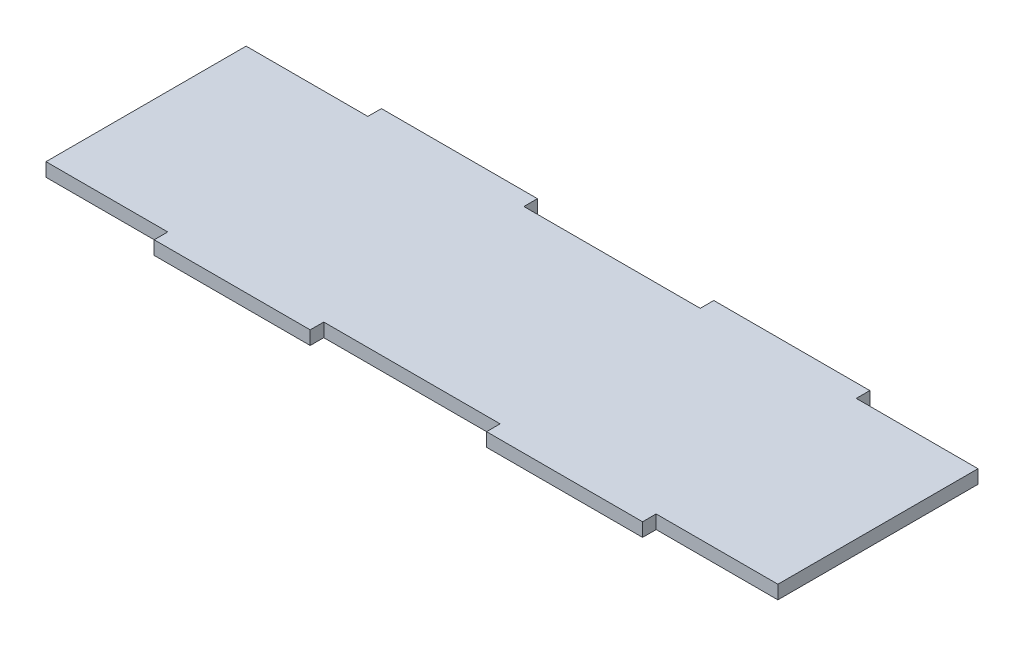
ISO-10303-21;
HEADER;
FILE_DESCRIPTION(('STEP AP214'),'2;1');
FILE_NAME('part.step','',(''),(''),'','','');
FILE_SCHEMA(('AUTOMOTIVE_DESIGN { 1 0 10303 214 1 1 1 1 }'));
ENDSEC;
DATA;
#1=APPLICATION_CONTEXT('core data for automotive mechanical design processes');
#2=APPLICATION_PROTOCOL_DEFINITION('international standard','automotive_design',2000,#1);
#3=PRODUCT_CONTEXT('',#1,'mechanical');
#4=PRODUCT('Part','Part','',(#3));
#5=PRODUCT_RELATED_PRODUCT_CATEGORY('part','',(#4));
#6=PRODUCT_DEFINITION_FORMATION('','',#4);
#7=PRODUCT_DEFINITION_CONTEXT('part definition',#1,'design');
#8=PRODUCT_DEFINITION('design','',#6,#7);
#9=PRODUCT_DEFINITION_SHAPE('','',#8);
#10=(LENGTH_UNIT() NAMED_UNIT(*) SI_UNIT(.MILLI.,.METRE.));
#11=(NAMED_UNIT(*) PLANE_ANGLE_UNIT() SI_UNIT($,.RADIAN.));
#12=(NAMED_UNIT(*) SI_UNIT($,.STERADIAN.) SOLID_ANGLE_UNIT());
#13=UNCERTAINTY_MEASURE_WITH_UNIT(LENGTH_MEASURE(1.E-05),#10,'distance_accuracy_value','');
#14=(GEOMETRIC_REPRESENTATION_CONTEXT(3) GLOBAL_UNCERTAINTY_ASSIGNED_CONTEXT((#13)) GLOBAL_UNIT_ASSIGNED_CONTEXT((#10,
#11,#12)) REPRESENTATION_CONTEXT('',''));
#15=CARTESIAN_POINT('',(0.,0.,0.));
#16=DIRECTION('',(0.,0.,1.));
#17=DIRECTION('',(1.,0.,0.));
#18=AXIS2_PLACEMENT_3D('',#15,#16,#17);
#19=CARTESIAN_POINT('',(-53.95,2.,14.75));
#20=DIRECTION('',(0.,0.,-1.));
#21=DIRECTION('',(-1.,0.,0.));
#22=AXIS2_PLACEMENT_3D('',#19,#20,#21);
#23=PLANE('',#22);
#24=DIRECTION('',(1.,0.,0.));
#25=VECTOR('',#24,1.);
#26=CARTESIAN_POINT('',(-53.95,2.,14.75));
#27=LINE('',#26,#25);
#28=CARTESIAN_POINT('',(-13.,2.,14.75));
#29=VERTEX_POINT('',#28);
#30=CARTESIAN_POINT('',(13.,2.,14.75));
#31=VERTEX_POINT('',#30);
#32=EDGE_CURVE('E55',#29,#31,#27,.T.);
#33=ORIENTED_EDGE('',*,*,#32,.F.);
#34=DIRECTION('',(0.,1.,0.));
#35=VECTOR('',#34,1.);
#36=CARTESIAN_POINT('',(-13.,0.,14.75));
#37=LINE('',#36,#35);
#38=CARTESIAN_POINT('',(-13.,0.,14.75));
#39=VERTEX_POINT('',#38);
#40=EDGE_CURVE('E218',#39,#29,#37,.T.);
#41=ORIENTED_EDGE('',*,*,#40,.F.);
#42=DIRECTION('',(1.,0.,0.));
#43=VECTOR('',#42,1.);
#44=CARTESIAN_POINT('',(-53.95,0.,14.75));
#45=LINE('',#44,#43);
#46=CARTESIAN_POINT('',(13.,0.,14.75));
#47=VERTEX_POINT('',#46);
#48=EDGE_CURVE('E367',#39,#47,#45,.T.);
#49=ORIENTED_EDGE('',*,*,#48,.T.);
#50=DIRECTION('',(0.,1.,0.));
#51=VECTOR('',#50,1.);
#52=CARTESIAN_POINT('',(13.,0.,14.75));
#53=LINE('',#52,#51);
#54=EDGE_CURVE('E238',#47,#31,#53,.T.);
#55=ORIENTED_EDGE('',*,*,#54,.T.);
#56=EDGE_LOOP('',(#33,#41,#49,#55));
#57=FACE_BOUND('',#56,.T.);
#58=ADVANCED_FACE('F39',(#57),#23,.F.);
#59=DIRECTION('',(0.,1.,0.));
#60=VECTOR('',#59,1.);
#61=CARTESIAN_POINT('',(36.,0.,14.75));
#62=LINE('',#61,#60);
#63=CARTESIAN_POINT('',(36.,0.,14.75));
#64=VERTEX_POINT('',#63);
#65=CARTESIAN_POINT('',(36.,2.,14.75));
#66=VERTEX_POINT('',#65);
#67=EDGE_CURVE('E249',#64,#66,#62,.T.);
#68=ORIENTED_EDGE('',*,*,#67,.F.);
#69=CARTESIAN_POINT('',(53.95,0.,14.75));
#70=VERTEX_POINT('',#69);
#71=EDGE_CURVE('E364',#64,#70,#45,.T.);
#72=ORIENTED_EDGE('',*,*,#71,.T.);
#73=DIRECTION('',(0.,-1.,0.));
#74=VECTOR('',#73,1.);
#75=CARTESIAN_POINT('',(53.95,2.,14.75));
#76=LINE('',#75,#74);
#77=CARTESIAN_POINT('',(53.95,2.,14.75));
#78=VERTEX_POINT('',#77);
#79=EDGE_CURVE('E352',#78,#70,#76,.T.);
#80=ORIENTED_EDGE('',*,*,#79,.F.);
#81=EDGE_CURVE('E348',#66,#78,#27,.T.);
#82=ORIENTED_EDGE('',*,*,#81,.F.);
#83=EDGE_LOOP('',(#68,#72,#80,#82));
#84=FACE_BOUND('',#83,.T.);
#85=ADVANCED_FACE('F423',(#84),#23,.F.);
#86=CARTESIAN_POINT('',(-53.95,2.,-14.75));
#87=DIRECTION('',(0.,0.,1.));
#88=DIRECTION('',(1.,0.,0.));
#89=AXIS2_PLACEMENT_3D('',#86,#87,#88);
#90=PLANE('',#89);
#91=DIRECTION('',(-1.,0.,0.));
#92=VECTOR('',#91,1.);
#93=CARTESIAN_POINT('',(-53.95,2.,-14.75));
#94=LINE('',#93,#92);
#95=CARTESIAN_POINT('',(13.,2.,-14.75));
#96=VERTEX_POINT('',#95);
#97=CARTESIAN_POINT('',(-13.,2.,-14.75));
#98=VERTEX_POINT('',#97);
#99=EDGE_CURVE('E345',#96,#98,#94,.T.);
#100=ORIENTED_EDGE('',*,*,#99,.F.);
#101=DIRECTION('',(0.,1.,0.));
#102=VECTOR('',#101,1.);
#103=CARTESIAN_POINT('',(13.,0.,-14.75));
#104=LINE('',#103,#102);
#105=CARTESIAN_POINT('',(13.,0.,-14.75));
#106=VERTEX_POINT('',#105);
#107=EDGE_CURVE('E274',#106,#96,#104,.T.);
#108=ORIENTED_EDGE('',*,*,#107,.F.);
#109=DIRECTION('',(-1.,0.,0.));
#110=VECTOR('',#109,1.);
#111=CARTESIAN_POINT('',(-53.95,0.,-14.75));
#112=LINE('',#111,#110);
#113=CARTESIAN_POINT('',(-13.,0.,-14.75));
#114=VERTEX_POINT('',#113);
#115=EDGE_CURVE('E361',#106,#114,#112,.T.);
#116=ORIENTED_EDGE('',*,*,#115,.T.);
#117=DIRECTION('',(0.,1.,0.));
#118=VECTOR('',#117,1.);
#119=CARTESIAN_POINT('',(-13.,0.,-14.75));
#120=LINE('',#119,#118);
#121=EDGE_CURVE('E328',#114,#98,#120,.T.);
#122=ORIENTED_EDGE('',*,*,#121,.T.);
#123=EDGE_LOOP('',(#100,#108,#116,#122));
#124=FACE_BOUND('',#123,.T.);
#125=ADVANCED_FACE('F402',(#124),#90,.F.);
#126=DIRECTION('',(0.,1.,0.));
#127=VECTOR('',#126,1.);
#128=CARTESIAN_POINT('',(-36.,0.,-14.75));
#129=LINE('',#128,#127);
#130=CARTESIAN_POINT('',(-36.,0.,-14.75));
#131=VERTEX_POINT('',#130);
#132=CARTESIAN_POINT('',(-36.,2.,-14.75));
#133=VERTEX_POINT('',#132);
#134=EDGE_CURVE('E310',#131,#133,#129,.T.);
#135=ORIENTED_EDGE('',*,*,#134,.F.);
#136=CARTESIAN_POINT('',(-53.95,0.,-14.75));
#137=VERTEX_POINT('',#136);
#138=EDGE_CURVE('E356',#131,#137,#112,.T.);
#139=ORIENTED_EDGE('',*,*,#138,.T.);
#140=DIRECTION('',(0.,-1.,0.));
#141=VECTOR('',#140,1.);
#142=CARTESIAN_POINT('',(-53.95,2.,-14.75));
#143=LINE('',#142,#141);
#144=CARTESIAN_POINT('',(-53.95,2.,-14.75));
#145=VERTEX_POINT('',#144);
#146=EDGE_CURVE('E48',#145,#137,#143,.T.);
#147=ORIENTED_EDGE('',*,*,#146,.F.);
#148=EDGE_CURVE('E338',#133,#145,#94,.T.);
#149=ORIENTED_EDGE('',*,*,#148,.F.);
#150=EDGE_LOOP('',(#135,#139,#147,#149));
#151=FACE_BOUND('',#150,.T.);
#152=ADVANCED_FACE('F406',(#151),#90,.F.);
#153=CARTESIAN_POINT('',(53.95,2.,-14.75));
#154=DIRECTION('',(-1.,0.,0.));
#155=DIRECTION('',(0.,0.,1.));
#156=AXIS2_PLACEMENT_3D('',#153,#154,#155);
#157=PLANE('',#156);
#158=DIRECTION('',(0.,0.,-1.));
#159=VECTOR('',#158,1.);
#160=CARTESIAN_POINT('',(53.95,0.,-14.75));
#161=LINE('',#160,#159);
#162=CARTESIAN_POINT('',(53.95,0.,-14.75));
#163=VERTEX_POINT('',#162);
#164=EDGE_CURVE('E324',#70,#163,#161,.T.);
#165=ORIENTED_EDGE('',*,*,#164,.T.);
#166=DIRECTION('',(0.,-1.,0.));
#167=VECTOR('',#166,1.);
#168=CARTESIAN_POINT('',(53.95,2.,-14.75));
#169=LINE('',#168,#167);
#170=CARTESIAN_POINT('',(53.95,2.,-14.75));
#171=VERTEX_POINT('',#170);
#172=EDGE_CURVE('E11',#171,#163,#169,.T.);
#173=ORIENTED_EDGE('',*,*,#172,.F.);
#174=DIRECTION('',(0.,0.,-1.));
#175=VECTOR('',#174,1.);
#176=CARTESIAN_POINT('',(53.95,2.,-14.75));
#177=LINE('',#176,#175);
#178=EDGE_CURVE('E334',#78,#171,#177,.T.);
#179=ORIENTED_EDGE('',*,*,#178,.F.);
#180=ORIENTED_EDGE('',*,*,#79,.T.);
#181=EDGE_LOOP('',(#165,#173,#179,#180));
#182=FACE_BOUND('',#181,.T.);
#183=ADVANCED_FACE('F41',(#182),#157,.F.);
#184=CARTESIAN_POINT('',(36.,0.,-14.75));
#185=VERTEX_POINT('',#184);
#186=EDGE_CURVE('E357',#163,#185,#112,.T.);
#187=ORIENTED_EDGE('',*,*,#186,.T.);
#188=DIRECTION('',(0.,1.,0.));
#189=VECTOR('',#188,1.);
#190=CARTESIAN_POINT('',(36.,0.,-14.75));
#191=LINE('',#190,#189);
#192=CARTESIAN_POINT('',(36.,2.,-14.75));
#193=VERTEX_POINT('',#192);
#194=EDGE_CURVE('E292',#185,#193,#191,.T.);
#195=ORIENTED_EDGE('',*,*,#194,.T.);
#196=EDGE_CURVE('E340',#171,#193,#94,.T.);
#197=ORIENTED_EDGE('',*,*,#196,.F.);
#198=ORIENTED_EDGE('',*,*,#172,.T.);
#199=EDGE_LOOP('',(#187,#195,#197,#198));
#200=FACE_BOUND('',#199,.T.);
#201=ADVANCED_FACE('F437',(#200),#90,.F.);
#202=CARTESIAN_POINT('',(-53.95,2.,-14.75));
#203=DIRECTION('',(1.,0.,0.));
#204=DIRECTION('',(0.,0.,-1.));
#205=AXIS2_PLACEMENT_3D('',#202,#203,#204);
#206=PLANE('',#205);
#207=DIRECTION('',(0.,0.,1.));
#208=VECTOR('',#207,1.);
#209=CARTESIAN_POINT('',(-53.95,0.,-14.75));
#210=LINE('',#209,#208);
#211=CARTESIAN_POINT('',(-53.95,0.,14.75));
#212=VERTEX_POINT('',#211);
#213=EDGE_CURVE('E360',#137,#212,#210,.T.);
#214=ORIENTED_EDGE('',*,*,#213,.T.);
#215=DIRECTION('',(0.,-1.,0.));
#216=VECTOR('',#215,1.);
#217=CARTESIAN_POINT('',(-53.95,2.,14.75));
#218=LINE('',#217,#216);
#219=CARTESIAN_POINT('',(-53.95,2.,14.75));
#220=VERTEX_POINT('',#219);
#221=EDGE_CURVE('E371',#220,#212,#218,.T.);
#222=ORIENTED_EDGE('',*,*,#221,.F.);
#223=DIRECTION('',(0.,0.,1.));
#224=VECTOR('',#223,1.);
#225=CARTESIAN_POINT('',(-53.95,2.,-14.75));
#226=LINE('',#225,#224);
#227=EDGE_CURVE('E344',#145,#220,#226,.T.);
#228=ORIENTED_EDGE('',*,*,#227,.F.);
#229=ORIENTED_EDGE('',*,*,#146,.T.);
#230=EDGE_LOOP('',(#214,#222,#228,#229));
#231=FACE_BOUND('',#230,.T.);
#232=ADVANCED_FACE('F380',(#231),#206,.F.);
#233=CARTESIAN_POINT('',(-36.,0.,14.75));
#234=VERTEX_POINT('',#233);
#235=EDGE_CURVE('E339',#212,#234,#45,.T.);
#236=ORIENTED_EDGE('',*,*,#235,.T.);
#237=DIRECTION('',(0.,1.,0.));
#238=VECTOR('',#237,1.);
#239=CARTESIAN_POINT('',(-36.,0.,14.75));
#240=LINE('',#239,#238);
#241=CARTESIAN_POINT('',(-36.,2.,14.75));
#242=VERTEX_POINT('',#241);
#243=EDGE_CURVE('E63',#234,#242,#240,.T.);
#244=ORIENTED_EDGE('',*,*,#243,.T.);
#245=EDGE_CURVE('E349',#220,#242,#27,.T.);
#246=ORIENTED_EDGE('',*,*,#245,.F.);
#247=ORIENTED_EDGE('',*,*,#221,.T.);
#248=EDGE_LOOP('',(#236,#244,#246,#247));
#249=FACE_BOUND('',#248,.T.);
#250=ADVANCED_FACE('F386',(#249),#23,.F.);
#251=CARTESIAN_POINT('',(0.,2.,0.));
#252=DIRECTION('',(0.,1.,0.));
#253=DIRECTION('',(0.,0.,1.));
#254=AXIS2_PLACEMENT_3D('',#251,#252,#253);
#255=PLANE('',#254);
#256=ORIENTED_EDGE('',*,*,#178,.T.);
#257=ORIENTED_EDGE('',*,*,#196,.T.);
#258=DIRECTION('',(0.,0.,-1.));
#259=VECTOR('',#258,1.);
#260=CARTESIAN_POINT('',(36.,2.,-14.75));
#261=LINE('',#260,#259);
#262=CARTESIAN_POINT('',(36.,2.,-16.75));
#263=VERTEX_POINT('',#262);
#264=EDGE_CURVE('E278',#193,#263,#261,.T.);
#265=ORIENTED_EDGE('',*,*,#264,.T.);
#266=DIRECTION('',(-1.,0.,0.));
#267=VECTOR('',#266,1.);
#268=CARTESIAN_POINT('',(13.,2.,-16.75));
#269=LINE('',#268,#267);
#270=CARTESIAN_POINT('',(13.,2.,-16.75));
#271=VERTEX_POINT('',#270);
#272=EDGE_CURVE('E266',#263,#271,#269,.T.);
#273=ORIENTED_EDGE('',*,*,#272,.T.);
#274=DIRECTION('',(0.,0.,1.));
#275=VECTOR('',#274,1.);
#276=CARTESIAN_POINT('',(13.,2.,-14.75));
#277=LINE('',#276,#275);
#278=EDGE_CURVE('E252',#271,#96,#277,.T.);
#279=ORIENTED_EDGE('',*,*,#278,.T.);
#280=ORIENTED_EDGE('',*,*,#99,.T.);
#281=DIRECTION('',(0.,0.,-1.));
#282=VECTOR('',#281,1.);
#283=CARTESIAN_POINT('',(-13.,2.,-14.75));
#284=LINE('',#283,#282);
#285=CARTESIAN_POINT('',(-13.,2.,-16.75));
#286=VERTEX_POINT('',#285);
#287=EDGE_CURVE('E314',#98,#286,#284,.T.);
#288=ORIENTED_EDGE('',*,*,#287,.T.);
#289=DIRECTION('',(-1.,0.,0.));
#290=VECTOR('',#289,1.);
#291=CARTESIAN_POINT('',(-36.,2.,-16.75));
#292=LINE('',#291,#290);
#293=CARTESIAN_POINT('',(-36.,2.,-16.75));
#294=VERTEX_POINT('',#293);
#295=EDGE_CURVE('E302',#286,#294,#292,.T.);
#296=ORIENTED_EDGE('',*,*,#295,.T.);
#297=DIRECTION('',(0.,0.,1.));
#298=VECTOR('',#297,1.);
#299=CARTESIAN_POINT('',(-36.,2.,-14.75));
#300=LINE('',#299,#298);
#301=EDGE_CURVE('E288',#294,#133,#300,.T.);
#302=ORIENTED_EDGE('',*,*,#301,.T.);
#303=ORIENTED_EDGE('',*,*,#148,.T.);
#304=ORIENTED_EDGE('',*,*,#227,.T.);
#305=ORIENTED_EDGE('',*,*,#245,.T.);
#306=DIRECTION('',(0.,0.,1.));
#307=VECTOR('',#306,1.);
#308=CARTESIAN_POINT('',(-36.,2.,14.75));
#309=LINE('',#308,#307);
#310=CARTESIAN_POINT('',(-36.,2.,16.75));
#311=VERTEX_POINT('',#310);
#312=EDGE_CURVE('E213',#242,#311,#309,.T.);
#313=ORIENTED_EDGE('',*,*,#312,.T.);
#314=DIRECTION('',(1.,0.,0.));
#315=VECTOR('',#314,1.);
#316=CARTESIAN_POINT('',(-36.,2.,16.75));
#317=LINE('',#316,#315);
#318=CARTESIAN_POINT('',(-13.,2.,16.75));
#319=VERTEX_POINT('',#318);
#320=EDGE_CURVE('E185',#311,#319,#317,.T.);
#321=ORIENTED_EDGE('',*,*,#320,.T.);
#322=DIRECTION('',(0.,0.,-1.));
#323=VECTOR('',#322,1.);
#324=CARTESIAN_POINT('',(-13.,2.,14.75));
#325=LINE('',#324,#323);
#326=EDGE_CURVE('E205',#319,#29,#325,.T.);
#327=ORIENTED_EDGE('',*,*,#326,.T.);
#328=ORIENTED_EDGE('',*,*,#32,.T.);
#329=DIRECTION('',(0.,0.,1.));
#330=VECTOR('',#329,1.);
#331=CARTESIAN_POINT('',(13.,2.,14.75));
#332=LINE('',#331,#330);
#333=CARTESIAN_POINT('',(13.,2.,16.75));
#334=VERTEX_POINT('',#333);
#335=EDGE_CURVE('E221',#31,#334,#332,.T.);
#336=ORIENTED_EDGE('',*,*,#335,.T.);
#337=DIRECTION('',(1.,0.,0.));
#338=VECTOR('',#337,1.);
#339=CARTESIAN_POINT('',(13.,2.,16.75));
#340=LINE('',#339,#338);
#341=CARTESIAN_POINT('',(36.,2.,16.75));
#342=VERTEX_POINT('',#341);
#343=EDGE_CURVE('E242',#334,#342,#340,.T.);
#344=ORIENTED_EDGE('',*,*,#343,.T.);
#345=DIRECTION('',(0.,0.,-1.));
#346=VECTOR('',#345,1.);
#347=CARTESIAN_POINT('',(36.,2.,14.75));
#348=LINE('',#347,#346);
#349=EDGE_CURVE('E231',#342,#66,#348,.T.);
#350=ORIENTED_EDGE('',*,*,#349,.T.);
#351=ORIENTED_EDGE('',*,*,#81,.T.);
#352=EDGE_LOOP('',(#256,#257,#265,#273,#279,#280,#288,#296,#302,#303,#304,#305,#313,#321,#327,
#328,#336,#344,#350,#351));
#353=FACE_BOUND('',#352,.T.);
#354=ADVANCED_FACE('F388',(#353),#255,.T.);
#355=CARTESIAN_POINT('',(0.,0.,0.));
#356=DIRECTION('',(0.,1.,0.));
#357=DIRECTION('',(0.,0.,1.));
#358=AXIS2_PLACEMENT_3D('',#355,#356,#357);
#359=PLANE('',#358);
#360=ORIENTED_EDGE('',*,*,#164,.F.);
#361=ORIENTED_EDGE('',*,*,#71,.F.);
#362=DIRECTION('',(0.,0.,-1.));
#363=VECTOR('',#362,1.);
#364=CARTESIAN_POINT('',(36.,0.,14.75));
#365=LINE('',#364,#363);
#366=CARTESIAN_POINT('',(36.,0.,16.75));
#367=VERTEX_POINT('',#366);
#368=EDGE_CURVE('E235',#367,#64,#365,.T.);
#369=ORIENTED_EDGE('',*,*,#368,.F.);
#370=DIRECTION('',(1.,0.,0.));
#371=VECTOR('',#370,1.);
#372=CARTESIAN_POINT('',(13.,0.,16.75));
#373=LINE('',#372,#371);
#374=CARTESIAN_POINT('',(13.,0.,16.75));
#375=VERTEX_POINT('',#374);
#376=EDGE_CURVE('E230',#375,#367,#373,.T.);
#377=ORIENTED_EDGE('',*,*,#376,.F.);
#378=DIRECTION('',(0.,0.,1.));
#379=VECTOR('',#378,1.);
#380=CARTESIAN_POINT('',(13.,0.,14.75));
#381=LINE('',#380,#379);
#382=EDGE_CURVE('E226',#47,#375,#381,.T.);
#383=ORIENTED_EDGE('',*,*,#382,.F.);
#384=ORIENTED_EDGE('',*,*,#48,.F.);
#385=DIRECTION('',(0.,0.,-1.));
#386=VECTOR('',#385,1.);
#387=CARTESIAN_POINT('',(-13.,0.,14.75));
#388=LINE('',#387,#386);
#389=CARTESIAN_POINT('',(-13.,0.,16.75));
#390=VERTEX_POINT('',#389);
#391=EDGE_CURVE('E200',#390,#39,#388,.T.);
#392=ORIENTED_EDGE('',*,*,#391,.F.);
#393=DIRECTION('',(1.,0.,0.));
#394=VECTOR('',#393,1.);
#395=CARTESIAN_POINT('',(-36.,0.,16.75));
#396=LINE('',#395,#394);
#397=CARTESIAN_POINT('',(-36.,0.,16.75));
#398=VERTEX_POINT('',#397);
#399=EDGE_CURVE('E182',#398,#390,#396,.T.);
#400=ORIENTED_EDGE('',*,*,#399,.F.);
#401=DIRECTION('',(0.,0.,1.));
#402=VECTOR('',#401,1.);
#403=CARTESIAN_POINT('',(-36.,0.,14.75));
#404=LINE('',#403,#402);
#405=EDGE_CURVE('E198',#234,#398,#404,.T.);
#406=ORIENTED_EDGE('',*,*,#405,.F.);
#407=ORIENTED_EDGE('',*,*,#235,.F.);
#408=ORIENTED_EDGE('',*,*,#213,.F.);
#409=ORIENTED_EDGE('',*,*,#138,.F.);
#410=DIRECTION('',(0.,0.,1.));
#411=VECTOR('',#410,1.);
#412=CARTESIAN_POINT('',(-36.,0.,-14.75));
#413=LINE('',#412,#411);
#414=CARTESIAN_POINT('',(-36.,0.,-16.75));
#415=VERTEX_POINT('',#414);
#416=EDGE_CURVE('E298',#415,#131,#413,.T.);
#417=ORIENTED_EDGE('',*,*,#416,.F.);
#418=DIRECTION('',(-1.,0.,0.));
#419=VECTOR('',#418,1.);
#420=CARTESIAN_POINT('',(-36.,0.,-16.75));
#421=LINE('',#420,#419);
#422=CARTESIAN_POINT('',(-13.,0.,-16.75));
#423=VERTEX_POINT('',#422);
#424=EDGE_CURVE('E306',#423,#415,#421,.T.);
#425=ORIENTED_EDGE('',*,*,#424,.F.);
#426=DIRECTION('',(0.,0.,-1.));
#427=VECTOR('',#426,1.);
#428=CARTESIAN_POINT('',(-13.,0.,-14.75));
#429=LINE('',#428,#427);
#430=EDGE_CURVE('E301',#114,#423,#429,.T.);
#431=ORIENTED_EDGE('',*,*,#430,.F.);
#432=ORIENTED_EDGE('',*,*,#115,.F.);
#433=DIRECTION('',(0.,0.,1.));
#434=VECTOR('',#433,1.);
#435=CARTESIAN_POINT('',(13.,0.,-14.75));
#436=LINE('',#435,#434);
#437=CARTESIAN_POINT('',(13.,0.,-16.75));
#438=VERTEX_POINT('',#437);
#439=EDGE_CURVE('E261',#438,#106,#436,.T.);
#440=ORIENTED_EDGE('',*,*,#439,.F.);
#441=DIRECTION('',(-1.,0.,0.));
#442=VECTOR('',#441,1.);
#443=CARTESIAN_POINT('',(13.,0.,-16.75));
#444=LINE('',#443,#442);
#445=CARTESIAN_POINT('',(36.,0.,-16.75));
#446=VERTEX_POINT('',#445);
#447=EDGE_CURVE('E270',#446,#438,#444,.T.);
#448=ORIENTED_EDGE('',*,*,#447,.F.);
#449=DIRECTION('',(0.,0.,-1.));
#450=VECTOR('',#449,1.);
#451=CARTESIAN_POINT('',(36.,0.,-14.75));
#452=LINE('',#451,#450);
#453=EDGE_CURVE('E265',#185,#446,#452,.T.);
#454=ORIENTED_EDGE('',*,*,#453,.F.);
#455=ORIENTED_EDGE('',*,*,#186,.F.);
#456=EDGE_LOOP('',(#360,#361,#369,#377,#383,#384,#392,#400,#406,#407,#408,#409,#417,#425,#431,
#432,#440,#448,#454,#455));
#457=FACE_BOUND('',#456,.T.);
#458=ADVANCED_FACE('F196',(#457),#359,.F.);
#459=CARTESIAN_POINT('',(-36.,0.,-14.75));
#460=DIRECTION('',(-1.,0.,0.));
#461=DIRECTION('',(0.,0.,1.));
#462=AXIS2_PLACEMENT_3D('',#459,#460,#461);
#463=PLANE('',#462);
#464=ORIENTED_EDGE('',*,*,#301,.F.);
#465=DIRECTION('',(0.,1.,0.));
#466=VECTOR('',#465,1.);
#467=CARTESIAN_POINT('',(-36.,0.,-16.75));
#468=LINE('',#467,#466);
#469=EDGE_CURVE('E321',#415,#294,#468,.T.);
#470=ORIENTED_EDGE('',*,*,#469,.F.);
#471=ORIENTED_EDGE('',*,*,#416,.T.);
#472=ORIENTED_EDGE('',*,*,#134,.T.);
#473=EDGE_LOOP('',(#464,#470,#471,#472));
#474=FACE_BOUND('',#473,.T.);
#475=ADVANCED_FACE('F408',(#474),#463,.T.);
#476=CARTESIAN_POINT('',(-36.,0.,-16.75));
#477=DIRECTION('',(0.,0.,-1.));
#478=DIRECTION('',(-1.,0.,0.));
#479=AXIS2_PLACEMENT_3D('',#476,#477,#478);
#480=PLANE('',#479);
#481=ORIENTED_EDGE('',*,*,#295,.F.);
#482=DIRECTION('',(0.,1.,0.));
#483=VECTOR('',#482,1.);
#484=CARTESIAN_POINT('',(-13.,0.,-16.75));
#485=LINE('',#484,#483);
#486=EDGE_CURVE('E325',#423,#286,#485,.T.);
#487=ORIENTED_EDGE('',*,*,#486,.F.);
#488=ORIENTED_EDGE('',*,*,#424,.T.);
#489=ORIENTED_EDGE('',*,*,#469,.T.);
#490=EDGE_LOOP('',(#481,#487,#488,#489));
#491=FACE_BOUND('',#490,.T.);
#492=ADVANCED_FACE('F411',(#491),#480,.T.);
#493=CARTESIAN_POINT('',(-13.,0.,-14.75));
#494=DIRECTION('',(1.,0.,0.));
#495=DIRECTION('',(0.,0.,-1.));
#496=AXIS2_PLACEMENT_3D('',#493,#494,#495);
#497=PLANE('',#496);
#498=ORIENTED_EDGE('',*,*,#287,.F.);
#499=ORIENTED_EDGE('',*,*,#121,.F.);
#500=ORIENTED_EDGE('',*,*,#430,.T.);
#501=ORIENTED_EDGE('',*,*,#486,.T.);
#502=EDGE_LOOP('',(#498,#499,#500,#501));
#503=FACE_BOUND('',#502,.T.);
#504=ADVANCED_FACE('F400',(#503),#497,.T.);
#505=CARTESIAN_POINT('',(13.,0.,-14.75));
#506=DIRECTION('',(-1.,0.,0.));
#507=DIRECTION('',(0.,0.,1.));
#508=AXIS2_PLACEMENT_3D('',#505,#506,#507);
#509=PLANE('',#508);
#510=ORIENTED_EDGE('',*,*,#278,.F.);
#511=DIRECTION('',(0.,1.,0.));
#512=VECTOR('',#511,1.);
#513=CARTESIAN_POINT('',(13.,0.,-16.75));
#514=LINE('',#513,#512);
#515=EDGE_CURVE('E285',#438,#271,#514,.T.);
#516=ORIENTED_EDGE('',*,*,#515,.F.);
#517=ORIENTED_EDGE('',*,*,#439,.T.);
#518=ORIENTED_EDGE('',*,*,#107,.T.);
#519=EDGE_LOOP('',(#510,#516,#517,#518));
#520=FACE_BOUND('',#519,.T.);
#521=ADVANCED_FACE('F418',(#520),#509,.T.);
#522=CARTESIAN_POINT('',(13.,0.,-16.75));
#523=DIRECTION('',(0.,0.,-1.));
#524=DIRECTION('',(-1.,0.,0.));
#525=AXIS2_PLACEMENT_3D('',#522,#523,#524);
#526=PLANE('',#525);
#527=ORIENTED_EDGE('',*,*,#272,.F.);
#528=DIRECTION('',(0.,1.,0.));
#529=VECTOR('',#528,1.);
#530=CARTESIAN_POINT('',(36.,0.,-16.75));
#531=LINE('',#530,#529);
#532=EDGE_CURVE('E289',#446,#263,#531,.T.);
#533=ORIENTED_EDGE('',*,*,#532,.F.);
#534=ORIENTED_EDGE('',*,*,#447,.T.);
#535=ORIENTED_EDGE('',*,*,#515,.T.);
#536=EDGE_LOOP('',(#527,#533,#534,#535));
#537=FACE_BOUND('',#536,.T.);
#538=ADVANCED_FACE('F536',(#537),#526,.T.);
#539=CARTESIAN_POINT('',(36.,0.,-14.75));
#540=DIRECTION('',(1.,0.,0.));
#541=DIRECTION('',(0.,0.,-1.));
#542=AXIS2_PLACEMENT_3D('',#539,#540,#541);
#543=PLANE('',#542);
#544=ORIENTED_EDGE('',*,*,#264,.F.);
#545=ORIENTED_EDGE('',*,*,#194,.F.);
#546=ORIENTED_EDGE('',*,*,#453,.T.);
#547=ORIENTED_EDGE('',*,*,#532,.T.);
#548=EDGE_LOOP('',(#544,#545,#546,#547));
#549=FACE_BOUND('',#548,.T.);
#550=ADVANCED_FACE('F545',(#549),#543,.T.);
#551=CARTESIAN_POINT('',(36.,0.,14.75));
#552=DIRECTION('',(1.,0.,0.));
#553=DIRECTION('',(0.,0.,-1.));
#554=AXIS2_PLACEMENT_3D('',#551,#552,#553);
#555=PLANE('',#554);
#556=ORIENTED_EDGE('',*,*,#349,.F.);
#557=DIRECTION('',(0.,1.,0.));
#558=VECTOR('',#557,1.);
#559=CARTESIAN_POINT('',(36.,0.,16.75));
#560=LINE('',#559,#558);
#561=EDGE_CURVE('E253',#367,#342,#560,.T.);
#562=ORIENTED_EDGE('',*,*,#561,.F.);
#563=ORIENTED_EDGE('',*,*,#368,.T.);
#564=ORIENTED_EDGE('',*,*,#67,.T.);
#565=EDGE_LOOP('',(#556,#562,#563,#564));
#566=FACE_BOUND('',#565,.T.);
#567=ADVANCED_FACE('F555',(#566),#555,.T.);
#568=CARTESIAN_POINT('',(13.,0.,16.75));
#569=DIRECTION('',(0.,0.,1.));
#570=DIRECTION('',(1.,0.,0.));
#571=AXIS2_PLACEMENT_3D('',#568,#569,#570);
#572=PLANE('',#571);
#573=ORIENTED_EDGE('',*,*,#343,.F.);
#574=DIRECTION('',(0.,1.,0.));
#575=VECTOR('',#574,1.);
#576=CARTESIAN_POINT('',(13.,0.,16.75));
#577=LINE('',#576,#575);
#578=EDGE_CURVE('E256',#375,#334,#577,.T.);
#579=ORIENTED_EDGE('',*,*,#578,.F.);
#580=ORIENTED_EDGE('',*,*,#376,.T.);
#581=ORIENTED_EDGE('',*,*,#561,.T.);
#582=EDGE_LOOP('',(#573,#579,#580,#581));
#583=FACE_BOUND('',#582,.T.);
#584=ADVANCED_FACE('F565',(#583),#572,.T.);
#585=CARTESIAN_POINT('',(13.,0.,14.75));
#586=DIRECTION('',(-1.,0.,0.));
#587=DIRECTION('',(0.,0.,1.));
#588=AXIS2_PLACEMENT_3D('',#585,#586,#587);
#589=PLANE('',#588);
#590=ORIENTED_EDGE('',*,*,#335,.F.);
#591=ORIENTED_EDGE('',*,*,#54,.F.);
#592=ORIENTED_EDGE('',*,*,#382,.T.);
#593=ORIENTED_EDGE('',*,*,#578,.T.);
#594=EDGE_LOOP('',(#590,#591,#592,#593));
#595=FACE_BOUND('',#594,.T.);
#596=ADVANCED_FACE('F575',(#595),#589,.T.);
#597=CARTESIAN_POINT('',(-13.,0.,14.75));
#598=DIRECTION('',(1.,0.,0.));
#599=DIRECTION('',(0.,0.,-1.));
#600=AXIS2_PLACEMENT_3D('',#597,#598,#599);
#601=PLANE('',#600);
#602=ORIENTED_EDGE('',*,*,#326,.F.);
#603=DIRECTION('',(0.,1.,0.));
#604=VECTOR('',#603,1.);
#605=CARTESIAN_POINT('',(-13.,0.,16.75));
#606=LINE('',#605,#604);
#607=EDGE_CURVE('E191',#390,#319,#606,.T.);
#608=ORIENTED_EDGE('',*,*,#607,.F.);
#609=ORIENTED_EDGE('',*,*,#391,.T.);
#610=ORIENTED_EDGE('',*,*,#40,.T.);
#611=EDGE_LOOP('',(#602,#608,#609,#610));
#612=FACE_BOUND('',#611,.T.);
#613=ADVANCED_FACE('F585',(#612),#601,.T.);
#614=CARTESIAN_POINT('',(-36.,0.,16.75));
#615=DIRECTION('',(0.,0.,1.));
#616=DIRECTION('',(1.,0.,0.));
#617=AXIS2_PLACEMENT_3D('',#614,#615,#616);
#618=PLANE('',#617);
#619=ORIENTED_EDGE('',*,*,#320,.F.);
#620=DIRECTION('',(0.,1.,0.));
#621=VECTOR('',#620,1.);
#622=CARTESIAN_POINT('',(-36.,0.,16.75));
#623=LINE('',#622,#621);
#624=EDGE_CURVE('E179',#398,#311,#623,.T.);
#625=ORIENTED_EDGE('',*,*,#624,.F.);
#626=ORIENTED_EDGE('',*,*,#399,.T.);
#627=ORIENTED_EDGE('',*,*,#607,.T.);
#628=EDGE_LOOP('',(#619,#625,#626,#627));
#629=FACE_BOUND('',#628,.T.);
#630=ADVANCED_FACE('F181',(#629),#618,.T.);
#631=CARTESIAN_POINT('',(-36.,0.,14.75));
#632=DIRECTION('',(-1.,0.,0.));
#633=DIRECTION('',(0.,0.,1.));
#634=AXIS2_PLACEMENT_3D('',#631,#632,#633);
#635=PLANE('',#634);
#636=ORIENTED_EDGE('',*,*,#312,.F.);
#637=ORIENTED_EDGE('',*,*,#243,.F.);
#638=ORIENTED_EDGE('',*,*,#405,.T.);
#639=ORIENTED_EDGE('',*,*,#624,.T.);
#640=EDGE_LOOP('',(#636,#637,#638,#639));
#641=FACE_BOUND('',#640,.T.);
#642=ADVANCED_FACE('F203',(#641),#635,.T.);
#643=CLOSED_SHELL('',(#58,#85,#125,#152,#183,#201,#232,#250,#354,#458,#475,#492,#504,#521,#538,
#550,#567,#584,#596,#613,#630,#642));
#644=MANIFOLD_SOLID_BREP('B2',#643);
#645=ADVANCED_BREP_SHAPE_REPRESENTATION('',(#18,#644),#14);
#646=SHAPE_DEFINITION_REPRESENTATION(#9,#645);
ENDSEC;
END-ISO-10303-21;
